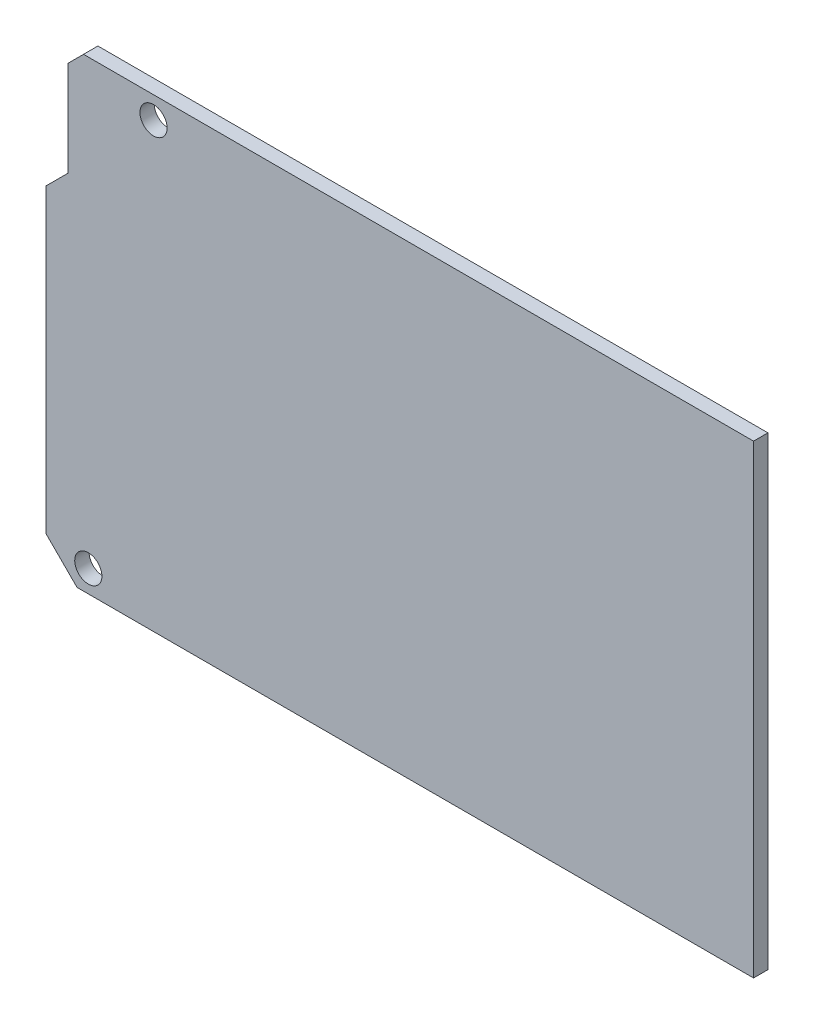
ISO-10303-21;
HEADER;
FILE_DESCRIPTION(('STEP AP214'),'2;1');
FILE_NAME('part.step','',(''),(''),'','','');
FILE_SCHEMA(('AUTOMOTIVE_DESIGN { 1 0 10303 214 1 1 1 1 }'));
ENDSEC;
DATA;
#1=APPLICATION_CONTEXT('core data for automotive mechanical design processes');
#2=APPLICATION_PROTOCOL_DEFINITION('international standard','automotive_design',2000,#1);
#3=PRODUCT_CONTEXT('',#1,'mechanical');
#4=PRODUCT('Part','Part','',(#3));
#5=PRODUCT_RELATED_PRODUCT_CATEGORY('part','',(#4));
#6=PRODUCT_DEFINITION_FORMATION('','',#4);
#7=PRODUCT_DEFINITION_CONTEXT('part definition',#1,'design');
#8=PRODUCT_DEFINITION('design','',#6,#7);
#9=PRODUCT_DEFINITION_SHAPE('','',#8);
#10=(LENGTH_UNIT() NAMED_UNIT(*) SI_UNIT(.MILLI.,.METRE.));
#11=(NAMED_UNIT(*) PLANE_ANGLE_UNIT() SI_UNIT($,.RADIAN.));
#12=(NAMED_UNIT(*) SI_UNIT($,.STERADIAN.) SOLID_ANGLE_UNIT());
#13=UNCERTAINTY_MEASURE_WITH_UNIT(LENGTH_MEASURE(1.E-05),#10,'distance_accuracy_value','');
#14=(GEOMETRIC_REPRESENTATION_CONTEXT(3) GLOBAL_UNCERTAINTY_ASSIGNED_CONTEXT((#13)) GLOBAL_UNIT_ASSIGNED_CONTEXT((#10,
#11,#12)) REPRESENTATION_CONTEXT('',''));
#15=CARTESIAN_POINT('',(0.,0.,0.));
#16=DIRECTION('',(0.,0.,1.));
#17=DIRECTION('',(1.,0.,0.));
#18=AXIS2_PLACEMENT_3D('',#15,#16,#17);
#19=CARTESIAN_POINT('',(-50.8,26.7081,1.651));
#20=DIRECTION('',(0.,-1.,0.));
#21=DIRECTION('',(0.,0.,-1.));
#22=AXIS2_PLACEMENT_3D('',#19,#20,#21);
#23=PLANE('',#22);
#24=DIRECTION('',(-1.,0.,0.));
#25=VECTOR('',#24,1.);
#26=CARTESIAN_POINT('',(-50.8,26.7081,1.651));
#27=LINE('',#26,#25);
#28=CARTESIAN_POINT('',(30.48,26.7081,1.651));
#29=VERTEX_POINT('',#28);
#30=CARTESIAN_POINT('',(-46.4965646997942,26.7081,1.651));
#31=VERTEX_POINT('',#30);
#32=EDGE_CURVE('E105',#29,#31,#27,.T.);
#33=ORIENTED_EDGE('',*,*,#32,.F.);
#34=DIRECTION('',(0.,0.,1.));
#35=VECTOR('',#34,1.);
#36=CARTESIAN_POINT('',(30.48,26.7081,0.));
#37=LINE('',#36,#35);
#38=CARTESIAN_POINT('',(30.48,26.7081,0.));
#39=VERTEX_POINT('',#38);
#40=EDGE_CURVE('E98',#39,#29,#37,.T.);
#41=ORIENTED_EDGE('',*,*,#40,.F.);
#42=DIRECTION('',(-1.,0.,0.));
#43=VECTOR('',#42,1.);
#44=CARTESIAN_POINT('',(-50.8,26.7081,0.));
#45=LINE('',#44,#43);
#46=CARTESIAN_POINT('',(-46.4965646997942,26.7081,0.));
#47=VERTEX_POINT('',#46);
#48=EDGE_CURVE('E56',#39,#47,#45,.T.);
#49=ORIENTED_EDGE('',*,*,#48,.T.);
#50=DIRECTION('',(0.,0.,-1.));
#51=VECTOR('',#50,1.);
#52=CARTESIAN_POINT('',(-46.4965646997942,26.7081,1.652));
#53=LINE('',#52,#51);
#54=EDGE_CURVE('E151',#31,#47,#53,.T.);
#55=ORIENTED_EDGE('',*,*,#54,.F.);
#56=EDGE_LOOP('',(#33,#41,#49,#55));
#57=FACE_BOUND('',#56,.T.);
#58=ADVANCED_FACE('F33',(#57),#23,.F.);
#59=CARTESIAN_POINT('',(-50.8,26.7081,1.651));
#60=DIRECTION('',(1.,0.,0.));
#61=DIRECTION('',(0.,0.,-1.));
#62=AXIS2_PLACEMENT_3D('',#59,#60,#61);
#63=PLANE('',#62);
#64=DIRECTION('',(0.,-1.,0.));
#65=VECTOR('',#64,1.);
#66=CARTESIAN_POINT('',(-50.8,26.7081,1.651));
#67=LINE('',#66,#65);
#68=CARTESIAN_POINT('',(-50.8,11.4681,1.651));
#69=VERTEX_POINT('',#68);
#70=CARTESIAN_POINT('',(-50.8,-23.1521,1.651));
#71=VERTEX_POINT('',#70);
#72=EDGE_CURVE('E137',#69,#71,#67,.T.);
#73=ORIENTED_EDGE('',*,*,#72,.F.);
#74=DIRECTION('',(0.,0.,-1.));
#75=VECTOR('',#74,1.);
#76=CARTESIAN_POINT('',(-50.8,11.4681,1.652));
#77=LINE('',#76,#75);
#78=CARTESIAN_POINT('',(-50.8,11.4681,0.));
#79=VERTEX_POINT('',#78);
#80=EDGE_CURVE('E114',#69,#79,#77,.T.);
#81=ORIENTED_EDGE('',*,*,#80,.T.);
#82=DIRECTION('',(0.,-1.,0.));
#83=VECTOR('',#82,1.);
#84=CARTESIAN_POINT('',(-50.8,26.7081,0.));
#85=LINE('',#84,#83);
#86=CARTESIAN_POINT('',(-50.8,-23.1521,0.));
#87=VERTEX_POINT('',#86);
#88=EDGE_CURVE('E113',#79,#87,#85,.T.);
#89=ORIENTED_EDGE('',*,*,#88,.T.);
#90=DIRECTION('',(0.,0.,1.));
#91=VECTOR('',#90,1.);
#92=CARTESIAN_POINT('',(-50.8,-23.1521,1.651));
#93=LINE('',#92,#91);
#94=EDGE_CURVE('E41',#87,#71,#93,.T.);
#95=ORIENTED_EDGE('',*,*,#94,.T.);
#96=EDGE_LOOP('',(#73,#81,#89,#95));
#97=FACE_BOUND('',#96,.T.);
#98=ADVANCED_FACE('F136',(#97),#63,.F.);
#99=CARTESIAN_POINT('',(-50.8,-26.7081,1.651));
#100=DIRECTION('',(0.,1.,0.));
#101=DIRECTION('',(0.,0.,1.));
#102=AXIS2_PLACEMENT_3D('',#99,#100,#101);
#103=PLANE('',#102);
#104=DIRECTION('',(1.,0.,0.));
#105=VECTOR('',#104,1.);
#106=CARTESIAN_POINT('',(-50.8,-26.7081,0.));
#107=LINE('',#106,#105);
#108=CARTESIAN_POINT('',(-47.244,-26.7081,0.));
#109=VERTEX_POINT('',#108);
#110=CARTESIAN_POINT('',(30.48,-26.7081,0.));
#111=VERTEX_POINT('',#110);
#112=EDGE_CURVE('E116',#109,#111,#107,.T.);
#113=ORIENTED_EDGE('',*,*,#112,.T.);
#114=DIRECTION('',(0.,0.,-1.));
#115=VECTOR('',#114,1.);
#116=CARTESIAN_POINT('',(30.48,-26.7081,0.));
#117=LINE('',#116,#115);
#118=CARTESIAN_POINT('',(30.48,-26.7081,1.651));
#119=VERTEX_POINT('',#118);
#120=EDGE_CURVE('E48',#119,#111,#117,.T.);
#121=ORIENTED_EDGE('',*,*,#120,.F.);
#122=DIRECTION('',(1.,0.,0.));
#123=VECTOR('',#122,1.);
#124=CARTESIAN_POINT('',(-50.8,-26.7081,1.651));
#125=LINE('',#124,#123);
#126=CARTESIAN_POINT('',(-47.244,-26.7081,1.651));
#127=VERTEX_POINT('',#126);
#128=EDGE_CURVE('E122',#127,#119,#125,.T.);
#129=ORIENTED_EDGE('',*,*,#128,.F.);
#130=DIRECTION('',(0.,0.,-1.));
#131=VECTOR('',#130,1.);
#132=CARTESIAN_POINT('',(-47.244,-26.7081,1.651));
#133=LINE('',#132,#131);
#134=EDGE_CURVE('E126',#127,#109,#133,.T.);
#135=ORIENTED_EDGE('',*,*,#134,.T.);
#136=EDGE_LOOP('',(#113,#121,#129,#135));
#137=FACE_BOUND('',#136,.T.);
#138=ADVANCED_FACE('F148',(#137),#103,.F.);
#139=CARTESIAN_POINT('',(50.8,-26.7081,1.651));
#140=DIRECTION('',(0.,0.,1.));
#141=DIRECTION('',(1.,0.,0.));
#142=AXIS2_PLACEMENT_3D('',#139,#140,#141);
#143=PLANE('',#142);
#144=DIRECTION('',(0.,-1.,0.));
#145=VECTOR('',#144,1.);
#146=CARTESIAN_POINT('',(30.48,26.7081,1.651));
#147=LINE('',#146,#145);
#148=EDGE_CURVE('E106',#29,#119,#147,.T.);
#149=ORIENTED_EDGE('',*,*,#148,.F.);
#150=ORIENTED_EDGE('',*,*,#32,.T.);
#151=DIRECTION('',(-0.707106781186552,-0.707106781186543,0.));
#152=VECTOR('',#151,1.);
#153=CARTESIAN_POINT('',(-48.26,24.9446646997942,1.651));
#154=LINE('',#153,#152);
#155=CARTESIAN_POINT('',(-48.26,24.9446646997942,1.651));
#156=VERTEX_POINT('',#155);
#157=EDGE_CURVE('E167',#31,#156,#154,.T.);
#158=ORIENTED_EDGE('',*,*,#157,.T.);
#159=DIRECTION('',(0.,-1.,0.));
#160=VECTOR('',#159,1.);
#161=CARTESIAN_POINT('',(-48.26,24.9446646997942,1.651));
#162=LINE('',#161,#160);
#163=CARTESIAN_POINT('',(-48.26,14.0081,1.651));
#164=VERTEX_POINT('',#163);
#165=EDGE_CURVE('E164',#156,#164,#162,.T.);
#166=ORIENTED_EDGE('',*,*,#165,.T.);
#167=DIRECTION('',(-0.707106781186547,-0.707106781186549,0.));
#168=VECTOR('',#167,1.);
#169=CARTESIAN_POINT('',(-50.8,11.4681,1.651));
#170=LINE('',#169,#168);
#171=EDGE_CURVE('E162',#164,#69,#170,.T.);
#172=ORIENTED_EDGE('',*,*,#171,.T.);
#173=ORIENTED_EDGE('',*,*,#72,.T.);
#174=DIRECTION('',(-0.707106781186545,0.70710678118655,0.));
#175=VECTOR('',#174,1.);
#176=CARTESIAN_POINT('',(1.77799999999968,-75.7301,1.651));
#177=LINE('',#176,#175);
#178=EDGE_CURVE('E11',#71,#127,#177,.F.);
#179=ORIENTED_EDGE('',*,*,#178,.T.);
#180=ORIENTED_EDGE('',*,*,#128,.T.);
#181=EDGE_LOOP('',(#149,#150,#158,#166,#172,#173,#179,#180));
#182=FACE_BOUND('',#181,.T.);
#183=CARTESIAN_POINT('',(-45.9486,-24.1681,1.651));
#184=DIRECTION('',(0.,0.,1.));
#185=DIRECTION('',(1.,0.,0.));
#186=AXIS2_PLACEMENT_3D('',#183,#184,#185);
#187=CIRCLE('',#186,1.5621);
#188=CARTESIAN_POINT('',(-44.3865,-24.1681,1.651));
#189=VERTEX_POINT('',#188);
#190=EDGE_CURVE('E177',#189,#189,#187,.F.);
#191=ORIENTED_EDGE('',*,*,#190,.T.);
#192=EDGE_LOOP('',(#191));
#193=FACE_BOUND('',#192,.T.);
#194=CARTESIAN_POINT('',(-38.4556,24.1681,1.651));
#195=DIRECTION('',(0.,0.,1.));
#196=DIRECTION('',(1.,0.,0.));
#197=AXIS2_PLACEMENT_3D('',#194,#195,#196);
#198=CIRCLE('',#197,1.5621);
#199=CARTESIAN_POINT('',(-36.8935,24.1681,1.651));
#200=VERTEX_POINT('',#199);
#201=EDGE_CURVE('E171',#200,#200,#198,.F.);
#202=ORIENTED_EDGE('',*,*,#201,.T.);
#203=EDGE_LOOP('',(#202));
#204=FACE_BOUND('',#203,.T.);
#205=ADVANCED_FACE('F144',(#182,#193,#204),#143,.T.);
#206=CARTESIAN_POINT('',(50.8,-26.7081,0.));
#207=DIRECTION('',(0.,0.,1.));
#208=DIRECTION('',(1.,0.,0.));
#209=AXIS2_PLACEMENT_3D('',#206,#207,#208);
#210=PLANE('',#209);
#211=CARTESIAN_POINT('',(-45.9486,-24.1681,0.));
#212=DIRECTION('',(0.,0.,-1.));
#213=DIRECTION('',(-1.,0.,0.));
#214=AXIS2_PLACEMENT_3D('',#211,#212,#213);
#215=CIRCLE('',#214,1.5621);
#216=CARTESIAN_POINT('',(-47.5107,-24.1681,0.));
#217=VERTEX_POINT('',#216);
#218=EDGE_CURVE('E174',#217,#217,#215,.T.);
#219=ORIENTED_EDGE('',*,*,#218,.F.);
#220=EDGE_LOOP('',(#219));
#221=FACE_BOUND('',#220,.T.);
#222=CARTESIAN_POINT('',(-38.4556,24.1681,0.));
#223=DIRECTION('',(0.,0.,-1.));
#224=DIRECTION('',(-1.,0.,0.));
#225=AXIS2_PLACEMENT_3D('',#222,#223,#224);
#226=CIRCLE('',#225,1.5621);
#227=CARTESIAN_POINT('',(-40.0177,24.1681,0.));
#228=VERTEX_POINT('',#227);
#229=EDGE_CURVE('E170',#228,#228,#226,.T.);
#230=ORIENTED_EDGE('',*,*,#229,.F.);
#231=EDGE_LOOP('',(#230));
#232=FACE_BOUND('',#231,.T.);
#233=ORIENTED_EDGE('',*,*,#48,.F.);
#234=DIRECTION('',(0.,1.,0.));
#235=VECTOR('',#234,1.);
#236=CARTESIAN_POINT('',(30.48,26.7081,0.));
#237=LINE('',#236,#235);
#238=EDGE_CURVE('E96',#111,#39,#237,.T.);
#239=ORIENTED_EDGE('',*,*,#238,.F.);
#240=ORIENTED_EDGE('',*,*,#112,.F.);
#241=DIRECTION('',(0.707106781186545,-0.70710678118655,0.));
#242=VECTOR('',#241,1.);
#243=CARTESIAN_POINT('',(-47.244,-26.7081,0.));
#244=LINE('',#243,#242);
#245=EDGE_CURVE('E129',#109,#87,#244,.F.);
#246=ORIENTED_EDGE('',*,*,#245,.T.);
#247=ORIENTED_EDGE('',*,*,#88,.F.);
#248=DIRECTION('',(-0.707106781186547,-0.707106781186548,0.));
#249=VECTOR('',#248,1.);
#250=CARTESIAN_POINT('',(-50.8,11.4681,0.));
#251=LINE('',#250,#249);
#252=CARTESIAN_POINT('',(-48.26,14.0081,0.));
#253=VERTEX_POINT('',#252);
#254=EDGE_CURVE('E154',#253,#79,#251,.T.);
#255=ORIENTED_EDGE('',*,*,#254,.F.);
#256=DIRECTION('',(0.,-1.,0.));
#257=VECTOR('',#256,1.);
#258=CARTESIAN_POINT('',(-48.26,24.9446646997942,0.));
#259=LINE('',#258,#257);
#260=CARTESIAN_POINT('',(-48.26,24.9446646997942,0.));
#261=VERTEX_POINT('',#260);
#262=EDGE_CURVE('E158',#261,#253,#259,.T.);
#263=ORIENTED_EDGE('',*,*,#262,.F.);
#264=DIRECTION('',(-0.707106781186552,-0.707106781186543,0.));
#265=VECTOR('',#264,1.);
#266=CARTESIAN_POINT('',(-48.26,24.9446646997942,0.));
#267=LINE('',#266,#265);
#268=EDGE_CURVE('E112',#47,#261,#267,.T.);
#269=ORIENTED_EDGE('',*,*,#268,.F.);
#270=EDGE_LOOP('',(#233,#239,#240,#246,#247,#255,#263,#269));
#271=FACE_BOUND('',#270,.T.);
#272=ADVANCED_FACE('F109',(#221,#232,#271),#210,.F.);
#273=CARTESIAN_POINT('',(-47.244,-26.7081,1.651));
#274=DIRECTION('',(0.70710678118655,0.707106781186545,0.));
#275=DIRECTION('',(-0.707106781186545,0.70710678118655,0.));
#276=AXIS2_PLACEMENT_3D('',#273,#274,#275);
#277=PLANE('',#276);
#278=ORIENTED_EDGE('',*,*,#178,.F.);
#279=ORIENTED_EDGE('',*,*,#94,.F.);
#280=ORIENTED_EDGE('',*,*,#245,.F.);
#281=ORIENTED_EDGE('',*,*,#134,.F.);
#282=EDGE_LOOP('',(#278,#279,#280,#281));
#283=FACE_BOUND('',#282,.T.);
#284=ADVANCED_FACE('F35',(#283),#277,.F.);
#285=CARTESIAN_POINT('',(-50.8,11.4681,1.652));
#286=DIRECTION('',(0.707106781186549,-0.707106781186547,0.));
#287=DIRECTION('',(0.707106781186547,0.707106781186549,0.));
#288=AXIS2_PLACEMENT_3D('',#285,#286,#287);
#289=PLANE('',#288);
#290=DIRECTION('',(0.,0.,-1.));
#291=VECTOR('',#290,1.);
#292=CARTESIAN_POINT('',(-48.26,14.0081,1.652));
#293=LINE('',#292,#291);
#294=EDGE_CURVE('E119',#164,#253,#293,.T.);
#295=ORIENTED_EDGE('',*,*,#294,.T.);
#296=ORIENTED_EDGE('',*,*,#254,.T.);
#297=ORIENTED_EDGE('',*,*,#80,.F.);
#298=ORIENTED_EDGE('',*,*,#171,.F.);
#299=EDGE_LOOP('',(#295,#296,#297,#298));
#300=FACE_BOUND('',#299,.T.);
#301=ADVANCED_FACE('F192',(#300),#289,.F.);
#302=CARTESIAN_POINT('',(-48.26,24.9446646997942,1.652));
#303=DIRECTION('',(1.,0.,0.));
#304=DIRECTION('',(0.,0.,-1.));
#305=AXIS2_PLACEMENT_3D('',#302,#303,#304);
#306=PLANE('',#305);
#307=DIRECTION('',(0.,0.,-1.));
#308=VECTOR('',#307,1.);
#309=CARTESIAN_POINT('',(-48.26,24.9446646997942,1.652));
#310=LINE('',#309,#308);
#311=EDGE_CURVE('E153',#156,#261,#310,.T.);
#312=ORIENTED_EDGE('',*,*,#311,.T.);
#313=ORIENTED_EDGE('',*,*,#262,.T.);
#314=ORIENTED_EDGE('',*,*,#294,.F.);
#315=ORIENTED_EDGE('',*,*,#165,.F.);
#316=EDGE_LOOP('',(#312,#313,#314,#315));
#317=FACE_BOUND('',#316,.T.);
#318=ADVANCED_FACE('F188',(#317),#306,.F.);
#319=CARTESIAN_POINT('',(-48.26,24.9446646997942,1.652));
#320=DIRECTION('',(0.707106781186543,-0.707106781186552,0.));
#321=DIRECTION('',(0.707106781186552,0.707106781186543,0.));
#322=AXIS2_PLACEMENT_3D('',#319,#320,#321);
#323=PLANE('',#322);
#324=ORIENTED_EDGE('',*,*,#54,.T.);
#325=ORIENTED_EDGE('',*,*,#268,.T.);
#326=ORIENTED_EDGE('',*,*,#311,.F.);
#327=ORIENTED_EDGE('',*,*,#157,.F.);
#328=EDGE_LOOP('',(#324,#325,#326,#327));
#329=FACE_BOUND('',#328,.T.);
#330=ADVANCED_FACE('F186',(#329),#323,.F.);
#331=CARTESIAN_POINT('',(-38.4556,24.1681,1.652));
#332=DIRECTION('',(0.,0.,-1.));
#333=DIRECTION('',(-1.,0.,0.));
#334=AXIS2_PLACEMENT_3D('',#331,#332,#333);
#335=CYLINDRICAL_SURFACE('',#334,1.5621);
#336=ORIENTED_EDGE('',*,*,#201,.F.);
#337=EDGE_LOOP('',(#336));
#338=FACE_BOUND('',#337,.T.);
#339=ORIENTED_EDGE('',*,*,#229,.T.);
#340=EDGE_LOOP('',(#339));
#341=FACE_BOUND('',#340,.T.);
#342=ADVANCED_FACE('F215',(#338,#341),#335,.F.);
#343=CARTESIAN_POINT('',(-45.9486,-24.1681,1.652));
#344=DIRECTION('',(0.,0.,-1.));
#345=DIRECTION('',(-1.,0.,0.));
#346=AXIS2_PLACEMENT_3D('',#343,#344,#345);
#347=CYLINDRICAL_SURFACE('',#346,1.5621);
#348=ORIENTED_EDGE('',*,*,#190,.F.);
#349=EDGE_LOOP('',(#348));
#350=FACE_BOUND('',#349,.T.);
#351=ORIENTED_EDGE('',*,*,#218,.T.);
#352=EDGE_LOOP('',(#351));
#353=FACE_BOUND('',#352,.T.);
#354=ADVANCED_FACE('F219',(#350,#353),#347,.F.);
#355=CARTESIAN_POINT('',(30.48,0.,0.));
#356=DIRECTION('',(-1.,0.,0.));
#357=DIRECTION('',(0.,0.,1.));
#358=AXIS2_PLACEMENT_3D('',#355,#356,#357);
#359=PLANE('',#358);
#360=ORIENTED_EDGE('',*,*,#238,.T.);
#361=ORIENTED_EDGE('',*,*,#40,.T.);
#362=ORIENTED_EDGE('',*,*,#148,.T.);
#363=ORIENTED_EDGE('',*,*,#120,.T.);
#364=EDGE_LOOP('',(#360,#361,#362,#363));
#365=FACE_BOUND('',#364,.T.);
#366=ADVANCED_FACE('F97',(#365),#359,.F.);
#367=CLOSED_SHELL('',(#58,#98,#138,#205,#272,#284,#301,#318,#330,#342,#354,#366));
#368=MANIFOLD_SOLID_BREP('B2',#367);
#369=ADVANCED_BREP_SHAPE_REPRESENTATION('',(#18,#368),#14);
#370=SHAPE_DEFINITION_REPRESENTATION(#9,#369);
ENDSEC;
END-ISO-10303-21;
